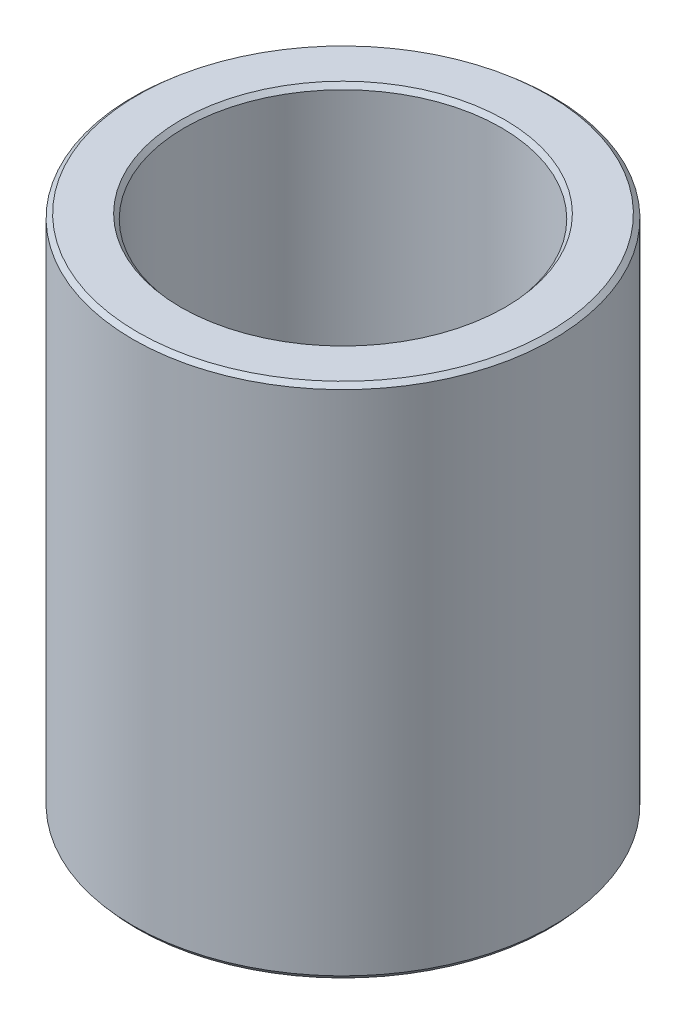
ISO-10303-21;
HEADER;
FILE_DESCRIPTION(('STEP AP214'),'2;1');
FILE_NAME('part.step','',(''),(''),'','','');
FILE_SCHEMA(('AUTOMOTIVE_DESIGN { 1 0 10303 214 1 1 1 1 }'));
ENDSEC;
DATA;
#1=APPLICATION_CONTEXT('core data for automotive mechanical design processes');
#2=APPLICATION_PROTOCOL_DEFINITION('international standard','automotive_design',2000,#1);
#3=PRODUCT_CONTEXT('',#1,'mechanical');
#4=PRODUCT('Part','Part','',(#3));
#5=PRODUCT_RELATED_PRODUCT_CATEGORY('part','',(#4));
#6=PRODUCT_DEFINITION_FORMATION('','',#4);
#7=PRODUCT_DEFINITION_CONTEXT('part definition',#1,'design');
#8=PRODUCT_DEFINITION('design','',#6,#7);
#9=PRODUCT_DEFINITION_SHAPE('','',#8);
#10=(LENGTH_UNIT() NAMED_UNIT(*) SI_UNIT(.MILLI.,.METRE.));
#11=(NAMED_UNIT(*) PLANE_ANGLE_UNIT() SI_UNIT($,.RADIAN.));
#12=(NAMED_UNIT(*) SI_UNIT($,.STERADIAN.) SOLID_ANGLE_UNIT());
#13=UNCERTAINTY_MEASURE_WITH_UNIT(LENGTH_MEASURE(1.E-05),#10,'distance_accuracy_value','');
#14=(GEOMETRIC_REPRESENTATION_CONTEXT(3) GLOBAL_UNCERTAINTY_ASSIGNED_CONTEXT((#13)) GLOBAL_UNIT_ASSIGNED_CONTEXT((#10,
#11,#12)) REPRESENTATION_CONTEXT('',''));
#15=CARTESIAN_POINT('',(0.,0.,0.));
#16=DIRECTION('',(0.,0.,1.));
#17=DIRECTION('',(1.,0.,0.));
#18=AXIS2_PLACEMENT_3D('',#15,#16,#17);
#19=CARTESIAN_POINT('',(0.,104.508108101425,0.));
#20=DIRECTION('',(0.,-1.,0.));
#21=DIRECTION('',(0.,0.,-1.));
#22=AXIS2_PLACEMENT_3D('',#19,#20,#21);
#23=CYLINDRICAL_SURFACE('',#22,42.5);
#24=CARTESIAN_POINT('',(0.,0.935169069566019,0.));
#25=DIRECTION('',(0.,1.,0.));
#26=DIRECTION('',(0.,0.,1.));
#27=AXIS2_PLACEMENT_3D('',#24,#25,#26);
#28=CIRCLE('',#27,42.5);
#29=CARTESIAN_POINT('',(0.,0.935169069566005,-42.5));
#30=VERTEX_POINT('',#29);
#31=EDGE_CURVE('E10',#30,#30,#28,.T.);
#32=CARTESIAN_POINT('',(0.,103.704724266332,0.));
#33=DIRECTION('',(0.,1.,0.));
#34=DIRECTION('',(0.,0.,1.));
#35=AXIS2_PLACEMENT_3D('',#32,#33,#34);
#36=CIRCLE('',#35,42.5);
#37=CARTESIAN_POINT('',(0.,103.704724266332,-42.5));
#38=VERTEX_POINT('',#37);
#39=EDGE_CURVE('E50',#38,#38,#36,.F.);
#40=CARTESIAN_POINT('',(0.,0.935169069566005,-42.5));
#41=CARTESIAN_POINT('',(0.,2.00568526953231,-42.5));
#42=CARTESIAN_POINT('',(0.,3.07620146949863,-42.5));
#43=CARTESIAN_POINT('',(0.,5.21723386943125,-42.5));
#44=CARTESIAN_POINT('',(0.,6.28775006939756,-42.5));
#45=CARTESIAN_POINT('',(0.,8.42878246933018,-42.5));
#46=CARTESIAN_POINT('',(0.,9.4992986692965,-42.5));
#47=CARTESIAN_POINT('',(0.,11.6403310692291,-42.5));
#48=CARTESIAN_POINT('',(0.,12.7108472691954,-42.5));
#49=CARTESIAN_POINT('',(0.,14.8518796691281,-42.5));
#50=CARTESIAN_POINT('',(0.,15.9223958690944,-42.5));
#51=CARTESIAN_POINT('',(0.,18.063428269027,-42.5));
#52=CARTESIAN_POINT('',(0.,19.1339444689933,-42.5));
#53=CARTESIAN_POINT('',(0.,21.2749768689259,-42.5));
#54=CARTESIAN_POINT('',(0.,22.3454930688922,-42.5));
#55=CARTESIAN_POINT('',(0.,24.4865254688248,-42.5));
#56=CARTESIAN_POINT('',(0.,25.5570416687912,-42.5));
#57=CARTESIAN_POINT('',(0.,27.6980740687238,-42.5));
#58=CARTESIAN_POINT('',(0.,28.7685902686901,-42.5));
#59=CARTESIAN_POINT('',(0.,30.9096226686227,-42.5));
#60=CARTESIAN_POINT('',(0.,31.980138868589,-42.5));
#61=CARTESIAN_POINT('',(0.,34.1211712685216,-42.5));
#62=CARTESIAN_POINT('',(0.,35.191687468488,-42.5));
#63=CARTESIAN_POINT('',(0.,37.3327198684206,-42.5));
#64=CARTESIAN_POINT('',(0.,38.4032360683869,-42.5));
#65=CARTESIAN_POINT('',(0.,40.5442684683195,-42.5));
#66=CARTESIAN_POINT('',(0.,41.6147846682858,-42.5));
#67=CARTESIAN_POINT('',(0.,43.7558170682184,-42.5));
#68=CARTESIAN_POINT('',(0.,44.8263332681848,-42.5));
#69=CARTESIAN_POINT('',(0.,46.9673656681174,-42.5));
#70=CARTESIAN_POINT('',(0.,48.0378818680837,-42.5));
#71=CARTESIAN_POINT('',(0.,50.1789142680163,-42.5));
#72=CARTESIAN_POINT('',(0.,51.2494304679826,-42.5));
#73=CARTESIAN_POINT('',(0.,53.3904628679152,-42.5));
#74=CARTESIAN_POINT('',(0.,54.4609790678816,-42.5));
#75=CARTESIAN_POINT('',(0.,56.6020114678142,-42.5));
#76=CARTESIAN_POINT('',(0.,57.6725276677805,-42.5));
#77=CARTESIAN_POINT('',(0.,59.8135600677131,-42.5));
#78=CARTESIAN_POINT('',(0.,60.8840762676794,-42.5));
#79=CARTESIAN_POINT('',(0.,63.025108667612,-42.5));
#80=CARTESIAN_POINT('',(0.,64.0956248675784,-42.5));
#81=CARTESIAN_POINT('',(0.,66.236657267511,-42.5));
#82=CARTESIAN_POINT('',(0.,67.3071734674773,-42.5));
#83=CARTESIAN_POINT('',(0.,69.4482058674099,-42.5));
#84=CARTESIAN_POINT('',(0.,70.5187220673762,-42.5));
#85=CARTESIAN_POINT('',(0.,72.6597544673088,-42.5));
#86=CARTESIAN_POINT('',(0.,73.7302706672751,-42.5));
#87=CARTESIAN_POINT('',(0.,75.8713030672078,-42.5));
#88=CARTESIAN_POINT('',(0.,76.9418192671741,-42.5));
#89=CARTESIAN_POINT('',(0.,79.0828516671067,-42.5));
#90=CARTESIAN_POINT('',(0.,80.153367867073,-42.5));
#91=CARTESIAN_POINT('',(0.,82.2944002670056,-42.5));
#92=CARTESIAN_POINT('',(0.,83.3649164669719,-42.5));
#93=CARTESIAN_POINT('',(0.,85.5059488669046,-42.5));
#94=CARTESIAN_POINT('',(0.,86.5764650668709,-42.5));
#95=CARTESIAN_POINT('',(0.,88.7174974668035,-42.5));
#96=CARTESIAN_POINT('',(0.,89.7880136667698,-42.5));
#97=CARTESIAN_POINT('',(0.,91.9290460667024,-42.5));
#98=CARTESIAN_POINT('',(0.,92.9995622666687,-42.5));
#99=CARTESIAN_POINT('',(0.,95.1405946666014,-42.5));
#100=CARTESIAN_POINT('',(0.,96.2111108665677,-42.5));
#101=CARTESIAN_POINT('',(0.,98.3521432665003,-42.5));
#102=CARTESIAN_POINT('',(0.,99.4226594664666,-42.5));
#103=CARTESIAN_POINT('',(0.,101.563691866399,-42.5));
#104=CARTESIAN_POINT('',(0.,102.634208066366,-42.5));
#105=CARTESIAN_POINT('',(0.,103.704724266332,-42.5));
#106=B_SPLINE_CURVE_WITH_KNOTS('',3,(#40,#41,#42,#43,#44,#45,#46,#47,#48,#49,#50,#51,#52,#53,
#54,#55,#56,#57,#58,#59,#60,#61,#62,#63,#64,#65,#66,#67,#68,#69,#70,#71,#72,#73,#74,#75,#76,#77,
#78,#79,#80,#81,#82,#83,#84,#85,#86,#87,#88,#89,#90,#91,#92,#93,#94,#95,#96,#97,#98,#99,#100,
#101,#102,#103,#104,#105),.UNSPECIFIED.,.F.,.F.,(4,2,2,2,2,2,2,2,2,2,2,2,2,2,2,2,2,2,2,2,2,2,2,
2,2,2,2,2,2,2,2,2,4),(0.,3.21154859989893,6.42309719979786,9.63464579969681,12.8461943995957,
16.0577429994947,19.2692915993936,22.4808401992925,25.6923887991915,28.9039373990904,
32.1154859989893,35.3270345988883,38.5385831987872,41.7501317986861,44.9616803985851,
48.173228998484,51.3847775983829,54.5963261982819,57.8078747981808,61.0194233980797,
64.2309719979787,67.4425205978776,70.6540691977765,73.8656177976755,77.0771663975744,
80.2887149974733,83.5002635973723,86.7118121972712,89.9233607971701,93.1349093970691,
96.346457996968,99.5580065968669,102.769555196766),.UNSPECIFIED.);
#107=EDGE_CURVE('BSEAM39',#30,#38,#106,.T.);
#108=ORIENTED_EDGE('',*,*,#31,.T.);
#109=ORIENTED_EDGE('',*,*,#39,.T.);
#110=ORIENTED_EDGE('',*,*,#107,.T.);
#111=ORIENTED_EDGE('',*,*,#107,.F.);
#112=EDGE_LOOP('',(#108,#110,#109,#111));
#113=FACE_BOUND('',#112,.T.);
#114=ADVANCED_FACE('F39',(#113),#23,.T.);
#115=CARTESIAN_POINT('',(0.,104.508108101425,0.));
#116=DIRECTION('',(0.,1.,0.));
#117=DIRECTION('',(0.,0.,1.));
#118=AXIS2_PLACEMENT_3D('',#115,#116,#117);
#119=PLANE('',#118);
#120=CARTESIAN_POINT('',(0.,104.508108101425,0.));
#121=DIRECTION('',(0.,1.,0.));
#122=DIRECTION('',(0.,0.,1.));
#123=AXIS2_PLACEMENT_3D('',#120,#121,#122);
#124=CIRCLE('',#123,32.8337795744413);
#125=CARTESIAN_POINT('',(0.,104.508108101425,32.8337795744413));
#126=VERTEX_POINT('',#125);
#127=EDGE_CURVE('E58',#126,#126,#124,.F.);
#128=ORIENTED_EDGE('',*,*,#127,.T.);
#129=EDGE_LOOP('',(#128));
#130=FACE_BOUND('',#129,.T.);
#131=CARTESIAN_POINT('',(0.,104.508108101425,0.));
#132=DIRECTION('',(0.,1.,0.));
#133=DIRECTION('',(0.,0.,1.));
#134=AXIS2_PLACEMENT_3D('',#131,#132,#133);
#135=CIRCLE('',#134,41.5648309304342);
#136=CARTESIAN_POINT('',(0.,104.508108101425,41.5648309304342));
#137=VERTEX_POINT('',#136);
#138=EDGE_CURVE('E61',#137,#137,#135,.T.);
#139=ORIENTED_EDGE('',*,*,#138,.T.);
#140=EDGE_LOOP('',(#139));
#141=FACE_BOUND('',#140,.T.);
#142=ADVANCED_FACE('F88',(#130,#141),#119,.T.);
#143=CARTESIAN_POINT('',(0.,0.,0.));
#144=DIRECTION('',(0.,1.,0.));
#145=DIRECTION('',(0.,0.,1.));
#146=AXIS2_PLACEMENT_3D('',#143,#144,#145);
#147=PLANE('',#146);
#148=CARTESIAN_POINT('',(0.,0.,0.));
#149=DIRECTION('',(0.,1.,0.));
#150=DIRECTION('',(0.,0.,1.));
#151=AXIS2_PLACEMENT_3D('',#148,#149,#150);
#152=CIRCLE('',#151,32.9655648089144);
#153=CARTESIAN_POINT('',(0.,0.,32.9655648089144));
#154=VERTEX_POINT('',#153);
#155=EDGE_CURVE('E51',#154,#154,#152,.T.);
#156=ORIENTED_EDGE('',*,*,#155,.T.);
#157=EDGE_LOOP('',(#156));
#158=FACE_BOUND('',#157,.T.);
#159=CARTESIAN_POINT('',(0.,0.,0.));
#160=DIRECTION('',(0.,1.,0.));
#161=DIRECTION('',(0.,0.,1.));
#162=AXIS2_PLACEMENT_3D('',#159,#160,#161);
#163=CIRCLE('',#162,41.6966161649072);
#164=CARTESIAN_POINT('',(0.,0.,41.6966161649072));
#165=VERTEX_POINT('',#164);
#166=EDGE_CURVE('E54',#165,#165,#163,.F.);
#167=ORIENTED_EDGE('',*,*,#166,.T.);
#168=EDGE_LOOP('',(#167));
#169=FACE_BOUND('',#168,.T.);
#170=ADVANCED_FACE('F83',(#158,#169),#147,.F.);
#171=CARTESIAN_POINT('',(0.,104.508108101425,0.));
#172=DIRECTION('',(0.,-1.,0.));
#173=DIRECTION('',(0.,0.,-1.));
#174=AXIS2_PLACEMENT_3D('',#171,#172,#173);
#175=CYLINDRICAL_SURFACE('',#174,32.0303957393486);
#176=CARTESIAN_POINT('',(0.,103.572939031859,0.));
#177=DIRECTION('',(0.,1.,0.));
#178=DIRECTION('',(0.,0.,1.));
#179=AXIS2_PLACEMENT_3D('',#176,#177,#178);
#180=CIRCLE('',#179,32.0303957393486);
#181=CARTESIAN_POINT('',(0.,103.572939031859,-32.0303957393486));
#182=VERTEX_POINT('',#181);
#183=EDGE_CURVE('E67',#182,#182,#180,.T.);
#184=CARTESIAN_POINT('',(0.,0.803383835092694,0.));
#185=DIRECTION('',(0.,1.,0.));
#186=DIRECTION('',(0.,0.,1.));
#187=AXIS2_PLACEMENT_3D('',#184,#185,#186);
#188=CIRCLE('',#187,32.0303957393486);
#189=CARTESIAN_POINT('',(0.,0.80338383509268,-32.0303957393486));
#190=VERTEX_POINT('',#189);
#191=EDGE_CURVE('E69',#190,#190,#188,.F.);
#192=CARTESIAN_POINT('',(0.,103.572939031859,-32.0303957393486));
#193=CARTESIAN_POINT('',(0.,102.502422831892,-32.0303957393486));
#194=CARTESIAN_POINT('',(0.,101.431906631926,-32.0303957393486));
#195=CARTESIAN_POINT('',(0.,99.2908742319933,-32.0303957393486));
#196=CARTESIAN_POINT('',(0.,98.220358032027,-32.0303957393486));
#197=CARTESIAN_POINT('',(0.,96.0793256320944,-32.0303957393486));
#198=CARTESIAN_POINT('',(0.,95.0088094321281,-32.0303957393486));
#199=CARTESIAN_POINT('',(0.,92.8677770321954,-32.0303957393486));
#200=CARTESIAN_POINT('',(0.,91.7972608322292,-32.0303957393486));
#201=CARTESIAN_POINT('',(0.,89.6562284322965,-32.0303957393486));
#202=CARTESIAN_POINT('',(0.,88.5857122323302,-32.0303957393486));
#203=CARTESIAN_POINT('',(0.,86.4446798323976,-32.0303957393486));
#204=CARTESIAN_POINT('',(0.,85.3741636324313,-32.0303957393486));
#205=CARTESIAN_POINT('',(0.,83.2331312324986,-32.0303957393486));
#206=CARTESIAN_POINT('',(0.,82.1626150325323,-32.0303957393486));
#207=CARTESIAN_POINT('',(0.,80.0215826325997,-32.0303957393486));
#208=CARTESIAN_POINT('',(0.,78.9510664326334,-32.0303957393486));
#209=CARTESIAN_POINT('',(0.,76.8100340327008,-32.0303957393486));
#210=CARTESIAN_POINT('',(0.,75.7395178327345,-32.0303957393486));
#211=CARTESIAN_POINT('',(0.,73.5984854328019,-32.0303957393486));
#212=CARTESIAN_POINT('',(0.,72.5279692328355,-32.0303957393486));
#213=CARTESIAN_POINT('',(0.,70.3869368329029,-32.0303957393486));
#214=CARTESIAN_POINT('',(0.,69.3164206329366,-32.0303957393486));
#215=CARTESIAN_POINT('',(0.,67.175388233004,-32.0303957393486));
#216=CARTESIAN_POINT('',(0.,66.1048720330377,-32.0303957393486));
#217=CARTESIAN_POINT('',(0.,63.963839633105,-32.0303957393486));
#218=CARTESIAN_POINT('',(0.,62.8933234331387,-32.0303957393486));
#219=CARTESIAN_POINT('',(0.,60.7522910332061,-32.0303957393486));
#220=CARTESIAN_POINT('',(0.,59.6817748332398,-32.0303957393486));
#221=CARTESIAN_POINT('',(0.,57.5407424333072,-32.0303957393486));
#222=CARTESIAN_POINT('',(0.,56.4702262333409,-32.0303957393486));
#223=CARTESIAN_POINT('',(0.,54.3291938334082,-32.0303957393486));
#224=CARTESIAN_POINT('',(0.,53.2586776334419,-32.0303957393486));
#225=CARTESIAN_POINT('',(0.,51.1176452335093,-32.0303957393486));
#226=CARTESIAN_POINT('',(0.,50.047129033543,-32.0303957393486));
#227=CARTESIAN_POINT('',(0.,47.9060966336104,-32.0303957393486));
#228=CARTESIAN_POINT('',(0.,46.8355804336441,-32.0303957393486));
#229=CARTESIAN_POINT('',(0.,44.6945480337114,-32.0303957393486));
#230=CARTESIAN_POINT('',(0.,43.6240318337451,-32.0303957393486));
#231=CARTESIAN_POINT('',(0.,41.4829994338125,-32.0303957393486));
#232=CARTESIAN_POINT('',(0.,40.4124832338462,-32.0303957393486));
#233=CARTESIAN_POINT('',(0.,38.2714508339136,-32.0303957393486));
#234=CARTESIAN_POINT('',(0.,37.2009346339473,-32.0303957393486));
#235=CARTESIAN_POINT('',(0.,35.0599022340146,-32.0303957393486));
#236=CARTESIAN_POINT('',(0.,33.9893860340483,-32.0303957393486));
#237=CARTESIAN_POINT('',(0.,31.8483536341157,-32.0303957393486));
#238=CARTESIAN_POINT('',(0.,30.7778374341494,-32.0303957393486));
#239=CARTESIAN_POINT('',(0.,28.6368050342168,-32.0303957393486));
#240=CARTESIAN_POINT('',(0.,27.5662888342505,-32.0303957393486));
#241=CARTESIAN_POINT('',(0.,25.4252564343178,-32.0303957393486));
#242=CARTESIAN_POINT('',(0.,24.3547402343515,-32.0303957393486));
#243=CARTESIAN_POINT('',(0.,22.2137078344189,-32.0303957393486));
#244=CARTESIAN_POINT('',(0.,21.1431916344526,-32.0303957393486));
#245=CARTESIAN_POINT('',(0.,19.00215923452,-32.0303957393486));
#246=CARTESIAN_POINT('',(0.,17.9316430345537,-32.0303957393486));
#247=CARTESIAN_POINT('',(0.,15.790610634621,-32.0303957393486));
#248=CARTESIAN_POINT('',(0.,14.7200944346547,-32.0303957393486));
#249=CARTESIAN_POINT('',(0.,12.5790620347221,-32.0303957393486));
#250=CARTESIAN_POINT('',(0.,11.5085458347558,-32.0303957393486));
#251=CARTESIAN_POINT('',(0.,9.36751343482317,-32.0303957393486));
#252=CARTESIAN_POINT('',(0.,8.29699723485686,-32.0303957393486));
#253=CARTESIAN_POINT('',(0.,6.15596483492423,-32.0303957393486));
#254=CARTESIAN_POINT('',(0.,5.08544863495792,-32.0303957393486));
#255=CARTESIAN_POINT('',(0.,2.9444162350253,-32.0303957393486));
#256=CARTESIAN_POINT('',(0.,1.87390003505899,-32.0303957393486));
#257=CARTESIAN_POINT('',(0.,0.80338383509268,-32.0303957393486));
#258=B_SPLINE_CURVE_WITH_KNOTS('',3,(#192,#193,#194,#195,#196,#197,#198,#199,#200,#201,#202,
#203,#204,#205,#206,#207,#208,#209,#210,#211,#212,#213,#214,#215,#216,#217,#218,#219,#220,#221,
#222,#223,#224,#225,#226,#227,#228,#229,#230,#231,#232,#233,#234,#235,#236,#237,#238,#239,#240,
#241,#242,#243,#244,#245,#246,#247,#248,#249,#250,#251,#252,#253,#254,#255,#256,#257),
.UNSPECIFIED.,.F.,.F.,(4,2,2,2,2,2,2,2,2,2,2,2,2,2,2,2,2,2,2,2,2,2,2,2,2,2,2,2,2,2,2,2,4),(0.,
3.21154859989893,6.42309719979786,9.63464579969679,12.8461943995957,16.0577429994947,
19.2692915993936,22.4808401992925,25.6923887991915,28.9039373990904,32.1154859989893,
35.3270345988883,38.5385831987872,41.7501317986861,44.9616803985851,48.173228998484,
51.3847775983829,54.5963261982819,57.8078747981808,61.0194233980797,64.2309719979787,
67.4425205978776,70.6540691977766,73.8656177976755,77.0771663975744,80.2887149974733,
83.5002635973723,86.7118121972712,89.9233607971701,93.1349093970691,96.346457996968,
99.5580065968669,102.769555196766),.UNSPECIFIED.);
#259=EDGE_CURVE('BSEAM71',#182,#190,#258,.T.);
#260=ORIENTED_EDGE('',*,*,#183,.T.);
#261=ORIENTED_EDGE('',*,*,#191,.T.);
#262=ORIENTED_EDGE('',*,*,#259,.T.);
#263=ORIENTED_EDGE('',*,*,#259,.F.);
#264=EDGE_LOOP('',(#260,#262,#261,#263));
#265=FACE_BOUND('',#264,.T.);
#266=ADVANCED_FACE('F71',(#265),#175,.F.);
#267=CARTESIAN_POINT('',(0.,103.572939031859,0.));
#268=DIRECTION('',(0.,1.,0.));
#269=DIRECTION('',(0.,0.,1.));
#270=AXIS2_PLACEMENT_3D('',#267,#268,#269);
#271=CONICAL_SURFACE('',#270,32.0303957393486,0.709741165723486);
#272=ORIENTED_EDGE('',*,*,#127,.F.);
#273=EDGE_LOOP('',(#272));
#274=FACE_BOUND('',#273,.T.);
#275=ORIENTED_EDGE('',*,*,#183,.F.);
#276=EDGE_LOOP('',(#275));
#277=FACE_BOUND('',#276,.T.);
#278=ADVANCED_FACE('F77',(#274,#277),#271,.F.);
#279=CARTESIAN_POINT('',(0.,0.,0.));
#280=DIRECTION('',(0.,-1.,0.));
#281=DIRECTION('',(0.,0.,-1.));
#282=AXIS2_PLACEMENT_3D('',#279,#280,#281);
#283=CONICAL_SURFACE('',#282,32.9655648089144,0.861055161071395);
#284=ORIENTED_EDGE('',*,*,#191,.F.);
#285=EDGE_LOOP('',(#284));
#286=FACE_BOUND('',#285,.T.);
#287=ORIENTED_EDGE('',*,*,#155,.F.);
#288=EDGE_LOOP('',(#287));
#289=FACE_BOUND('',#288,.T.);
#290=ADVANCED_FACE('F73',(#286,#289),#283,.F.);
#291=CARTESIAN_POINT('',(0.,0.935169069566019,0.));
#292=DIRECTION('',(0.,1.,0.));
#293=DIRECTION('',(0.,0.,1.));
#294=AXIS2_PLACEMENT_3D('',#291,#292,#293);
#295=CONICAL_SURFACE('',#294,42.5,0.709741165723495);
#296=ORIENTED_EDGE('',*,*,#166,.F.);
#297=EDGE_LOOP('',(#296));
#298=FACE_BOUND('',#297,.T.);
#299=ORIENTED_EDGE('',*,*,#31,.F.);
#300=EDGE_LOOP('',(#299));
#301=FACE_BOUND('',#300,.T.);
#302=ADVANCED_FACE('F76',(#298,#301),#295,.T.);
#303=CARTESIAN_POINT('',(0.,104.508108101425,0.));
#304=DIRECTION('',(0.,-1.,0.));
#305=DIRECTION('',(0.,0.,-1.));
#306=AXIS2_PLACEMENT_3D('',#303,#304,#305);
#307=CONICAL_SURFACE('',#306,41.5648309304342,0.861055161071408);
#308=ORIENTED_EDGE('',*,*,#39,.F.);
#309=EDGE_LOOP('',(#308));
#310=FACE_BOUND('',#309,.T.);
#311=ORIENTED_EDGE('',*,*,#138,.F.);
#312=EDGE_LOOP('',(#311));
#313=FACE_BOUND('',#312,.T.);
#314=ADVANCED_FACE('F45',(#310,#313),#307,.T.);
#315=CLOSED_SHELL('',(#114,#142,#170,#266,#278,#290,#302,#314));
#316=MANIFOLD_SOLID_BREP('B2',#315);
#317=ADVANCED_BREP_SHAPE_REPRESENTATION('',(#18,#316),#14);
#318=SHAPE_DEFINITION_REPRESENTATION(#9,#317);
ENDSEC;
END-ISO-10303-21;
